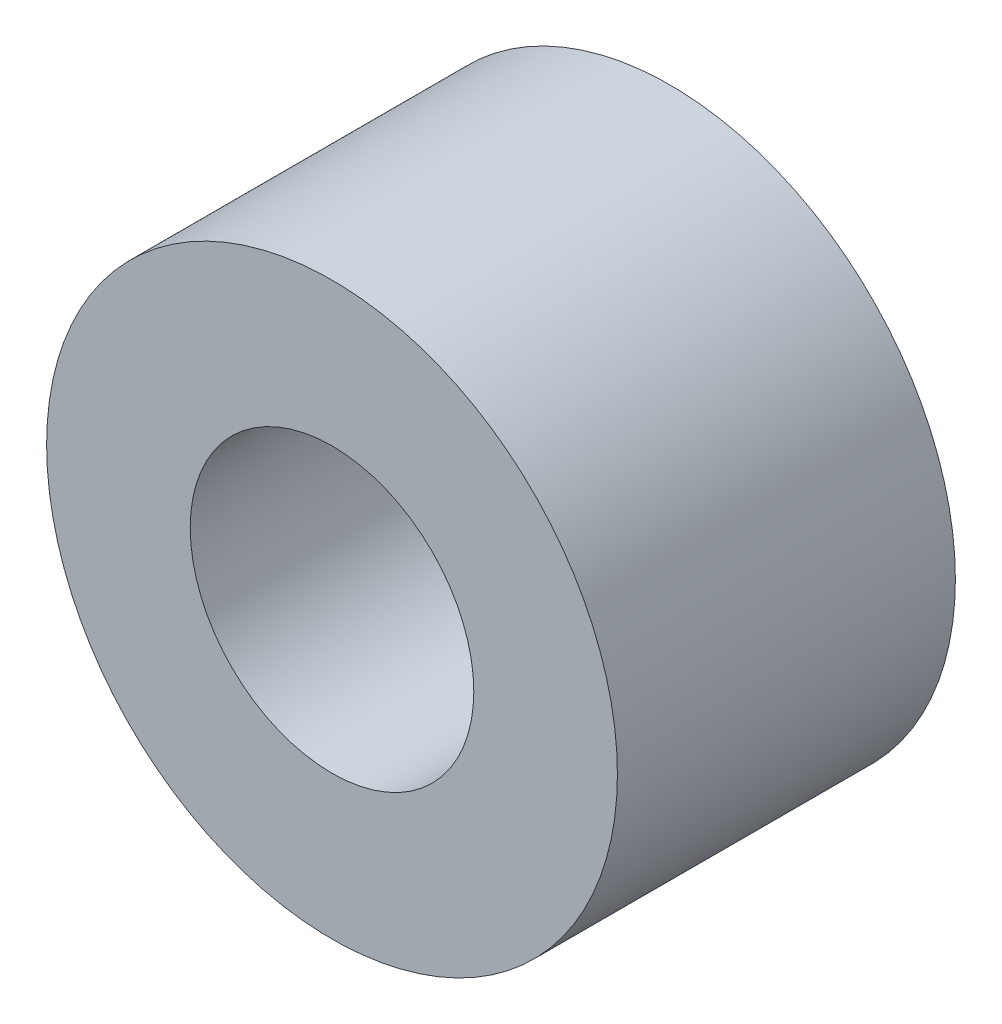
ISO-10303-21;
HEADER;
FILE_DESCRIPTION(('STEP AP214'),'2;1');
FILE_NAME('part.step','',(''),(''),'','','');
FILE_SCHEMA(('AUTOMOTIVE_DESIGN { 1 0 10303 214 1 1 1 1 }'));
ENDSEC;
DATA;
#1=APPLICATION_CONTEXT('core data for automotive mechanical design processes');
#2=APPLICATION_PROTOCOL_DEFINITION('international standard','automotive_design',2000,#1);
#3=PRODUCT_CONTEXT('',#1,'mechanical');
#4=PRODUCT('Part','Part','',(#3));
#5=PRODUCT_RELATED_PRODUCT_CATEGORY('part','',(#4));
#6=PRODUCT_DEFINITION_FORMATION('','',#4);
#7=PRODUCT_DEFINITION_CONTEXT('part definition',#1,'design');
#8=PRODUCT_DEFINITION('design','',#6,#7);
#9=PRODUCT_DEFINITION_SHAPE('','',#8);
#10=(LENGTH_UNIT() NAMED_UNIT(*) SI_UNIT(.MILLI.,.METRE.));
#11=(NAMED_UNIT(*) PLANE_ANGLE_UNIT() SI_UNIT($,.RADIAN.));
#12=(NAMED_UNIT(*) SI_UNIT($,.STERADIAN.) SOLID_ANGLE_UNIT());
#13=UNCERTAINTY_MEASURE_WITH_UNIT(LENGTH_MEASURE(1.E-05),#10,'distance_accuracy_value','');
#14=(GEOMETRIC_REPRESENTATION_CONTEXT(3) GLOBAL_UNCERTAINTY_ASSIGNED_CONTEXT((#13)) GLOBAL_UNIT_ASSIGNED_CONTEXT((#10,
#11,#12)) REPRESENTATION_CONTEXT('',''));
#15=CARTESIAN_POINT('',(0.,0.,0.));
#16=DIRECTION('',(0.,0.,1.));
#17=DIRECTION('',(1.,0.,0.));
#18=AXIS2_PLACEMENT_3D('',#15,#16,#17);
#19=CARTESIAN_POINT('',(0.,0.,18.));
#20=DIRECTION('',(0.,0.,1.));
#21=DIRECTION('',(1.,0.,0.));
#22=AXIS2_PLACEMENT_3D('',#19,#20,#21);
#23=PLANE('',#22);
#24=CARTESIAN_POINT('',(0.,0.,18.));
#25=DIRECTION('',(0.,0.,1.));
#26=DIRECTION('',(1.,0.,0.));
#27=AXIS2_PLACEMENT_3D('',#24,#25,#26);
#28=CIRCLE('',#27,15.2);
#29=CARTESIAN_POINT('',(15.2,0.,18.));
#30=VERTEX_POINT('',#29);
#31=EDGE_CURVE('E10',#30,#30,#28,.T.);
#32=ORIENTED_EDGE('',*,*,#31,.T.);
#33=EDGE_LOOP('',(#32));
#34=FACE_BOUND('',#33,.T.);
#35=CARTESIAN_POINT('',(0.,0.,18.));
#36=DIRECTION('',(0.,0.,1.));
#37=DIRECTION('',(1.,0.,0.));
#38=AXIS2_PLACEMENT_3D('',#35,#36,#37);
#39=CIRCLE('',#38,7.55127811164512);
#40=CARTESIAN_POINT('',(7.55127811164512,0.,18.));
#41=VERTEX_POINT('',#40);
#42=EDGE_CURVE('E52',#41,#41,#39,.T.);
#43=ORIENTED_EDGE('',*,*,#42,.F.);
#44=EDGE_LOOP('',(#43));
#45=FACE_BOUND('',#44,.T.);
#46=ADVANCED_FACE('F39',(#34,#45),#23,.T.);
#47=CARTESIAN_POINT('',(0.,0.,0.));
#48=DIRECTION('',(0.,0.,1.));
#49=DIRECTION('',(1.,0.,0.));
#50=AXIS2_PLACEMENT_3D('',#47,#48,#49);
#51=PLANE('',#50);
#52=CARTESIAN_POINT('',(0.,0.,0.));
#53=DIRECTION('',(0.,0.,1.));
#54=DIRECTION('',(1.,0.,0.));
#55=AXIS2_PLACEMENT_3D('',#52,#53,#54);
#56=CIRCLE('',#55,15.2);
#57=CARTESIAN_POINT('',(15.2,0.,0.));
#58=VERTEX_POINT('',#57);
#59=EDGE_CURVE('E43',#58,#58,#56,.T.);
#60=ORIENTED_EDGE('',*,*,#59,.F.);
#61=EDGE_LOOP('',(#60));
#62=FACE_BOUND('',#61,.T.);
#63=CARTESIAN_POINT('',(0.,0.,0.));
#64=DIRECTION('',(0.,0.,1.));
#65=DIRECTION('',(1.,0.,0.));
#66=AXIS2_PLACEMENT_3D('',#63,#64,#65);
#67=CIRCLE('',#66,7.55127811164512);
#68=CARTESIAN_POINT('',(7.55127811164512,0.,0.));
#69=VERTEX_POINT('',#68);
#70=EDGE_CURVE('E54',#69,#69,#67,.T.);
#71=ORIENTED_EDGE('',*,*,#70,.T.);
#72=EDGE_LOOP('',(#71));
#73=FACE_BOUND('',#72,.T.);
#74=ADVANCED_FACE('F66',(#62,#73),#51,.F.);
#75=CARTESIAN_POINT('',(0.,0.,18.));
#76=DIRECTION('',(0.,0.,-1.));
#77=DIRECTION('',(-1.,0.,0.));
#78=AXIS2_PLACEMENT_3D('',#75,#76,#77);
#79=CYLINDRICAL_SURFACE('',#78,15.2);
#80=ORIENTED_EDGE('',*,*,#31,.F.);
#81=EDGE_LOOP('',(#80));
#82=FACE_BOUND('',#81,.T.);
#83=ORIENTED_EDGE('',*,*,#59,.T.);
#84=EDGE_LOOP('',(#83));
#85=FACE_BOUND('',#84,.T.);
#86=ADVANCED_FACE('F41',(#82,#85),#79,.T.);
#87=CARTESIAN_POINT('',(0.,0.,18.));
#88=DIRECTION('',(0.,0.,-1.));
#89=DIRECTION('',(-1.,0.,0.));
#90=AXIS2_PLACEMENT_3D('',#87,#88,#89);
#91=CYLINDRICAL_SURFACE('',#90,7.55127811164512);
#92=ORIENTED_EDGE('',*,*,#42,.T.);
#93=EDGE_LOOP('',(#92));
#94=FACE_BOUND('',#93,.T.);
#95=ORIENTED_EDGE('',*,*,#70,.F.);
#96=EDGE_LOOP('',(#95));
#97=FACE_BOUND('',#96,.T.);
#98=ADVANCED_FACE('F62',(#94,#97),#91,.F.);
#99=CLOSED_SHELL('',(#46,#74,#86,#98));
#100=MANIFOLD_SOLID_BREP('B2',#99);
#101=ADVANCED_BREP_SHAPE_REPRESENTATION('',(#18,#100),#14);
#102=SHAPE_DEFINITION_REPRESENTATION(#9,#101);
ENDSEC;
END-ISO-10303-21;
